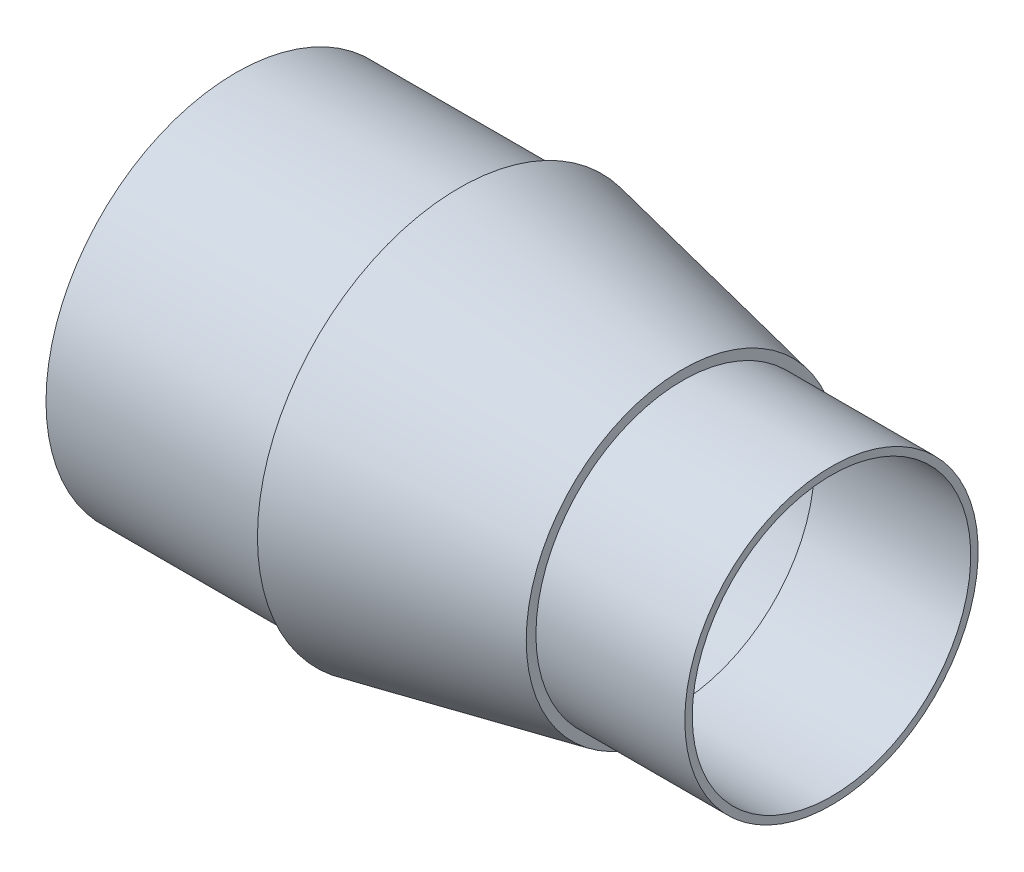
ISO-10303-21;
HEADER;
FILE_DESCRIPTION(('STEP AP214'),'2;1');
FILE_NAME('part.step','',(''),(''),'','','');
FILE_SCHEMA(('AUTOMOTIVE_DESIGN { 1 0 10303 214 1 1 1 1 }'));
ENDSEC;
DATA;
#1=APPLICATION_CONTEXT('core data for automotive mechanical design processes');
#2=APPLICATION_PROTOCOL_DEFINITION('international standard','automotive_design',2000,#1);
#3=PRODUCT_CONTEXT('',#1,'mechanical');
#4=PRODUCT('Part','Part','',(#3));
#5=PRODUCT_RELATED_PRODUCT_CATEGORY('part','',(#4));
#6=PRODUCT_DEFINITION_FORMATION('','',#4);
#7=PRODUCT_DEFINITION_CONTEXT('part definition',#1,'design');
#8=PRODUCT_DEFINITION('design','',#6,#7);
#9=PRODUCT_DEFINITION_SHAPE('','',#8);
#10=(LENGTH_UNIT() NAMED_UNIT(*) SI_UNIT(.MILLI.,.METRE.));
#11=(NAMED_UNIT(*) PLANE_ANGLE_UNIT() SI_UNIT($,.RADIAN.));
#12=(NAMED_UNIT(*) SI_UNIT($,.STERADIAN.) SOLID_ANGLE_UNIT());
#13=UNCERTAINTY_MEASURE_WITH_UNIT(LENGTH_MEASURE(1.E-05),#10,'distance_accuracy_value','');
#14=(GEOMETRIC_REPRESENTATION_CONTEXT(3) GLOBAL_UNCERTAINTY_ASSIGNED_CONTEXT((#13)) GLOBAL_UNIT_ASSIGNED_CONTEXT((#10,
#11,#12)) REPRESENTATION_CONTEXT('',''));
#15=CARTESIAN_POINT('',(0.,0.,0.));
#16=DIRECTION('',(0.,0.,1.));
#17=DIRECTION('',(1.,0.,0.));
#18=AXIS2_PLACEMENT_3D('',#15,#16,#17);
#19=CARTESIAN_POINT('',(0.,0.,-64.77));
#20=DIRECTION('',(1.,0.,0.));
#21=DIRECTION('',(0.,0.,-1.));
#22=AXIS2_PLACEMENT_3D('',#19,#20,#21);
#23=PLANE('',#22);
#24=CARTESIAN_POINT('',(0.,0.,0.));
#25=DIRECTION('',(1.,0.,0.));
#26=DIRECTION('',(0.,0.,-1.));
#27=AXIS2_PLACEMENT_3D('',#24,#25,#26);
#28=CIRCLE('',#27,62.23);
#29=CARTESIAN_POINT('',(0.,0.,-62.23));
#30=VERTEX_POINT('',#29);
#31=EDGE_CURVE('E60',#30,#30,#28,.F.);
#32=ORIENTED_EDGE('',*,*,#31,.F.);
#33=EDGE_LOOP('',(#32));
#34=FACE_BOUND('',#33,.T.);
#35=CARTESIAN_POINT('',(0.,0.,0.));
#36=DIRECTION('',(-1.,0.,0.));
#37=DIRECTION('',(0.,0.,1.));
#38=AXIS2_PLACEMENT_3D('',#35,#36,#37);
#39=CIRCLE('',#38,64.77);
#40=CARTESIAN_POINT('',(0.,0.,64.77));
#41=VERTEX_POINT('',#40);
#42=EDGE_CURVE('E10',#41,#41,#39,.T.);
#43=ORIENTED_EDGE('',*,*,#42,.T.);
#44=EDGE_LOOP('',(#43));
#45=FACE_BOUND('',#44,.T.);
#46=ADVANCED_FACE('F35',(#34,#45),#23,.F.);
#47=CARTESIAN_POINT('',(0.,0.,0.));
#48=DIRECTION('',(-1.,0.,0.));
#49=DIRECTION('',(0.,0.,1.));
#50=AXIS2_PLACEMENT_3D('',#47,#48,#49);
#51=CYLINDRICAL_SURFACE('',#50,64.77);
#52=ORIENTED_EDGE('',*,*,#42,.F.);
#53=EDGE_LOOP('',(#52));
#54=FACE_BOUND('',#53,.T.);
#55=CARTESIAN_POINT('',(76.2,0.,0.));
#56=DIRECTION('',(-1.,0.,0.));
#57=DIRECTION('',(0.,0.,1.));
#58=AXIS2_PLACEMENT_3D('',#55,#56,#57);
#59=CIRCLE('',#58,64.77);
#60=CARTESIAN_POINT('',(76.2,0.,64.77));
#61=VERTEX_POINT('',#60);
#62=EDGE_CURVE('E41',#61,#61,#59,.T.);
#63=ORIENTED_EDGE('',*,*,#62,.T.);
#64=EDGE_LOOP('',(#63));
#65=FACE_BOUND('',#64,.T.);
#66=ADVANCED_FACE('F97',(#54,#65),#51,.T.);
#67=CARTESIAN_POINT('',(76.2,0.,-68.834));
#68=DIRECTION('',(1.,0.,0.));
#69=DIRECTION('',(0.,0.,-1.));
#70=AXIS2_PLACEMENT_3D('',#67,#68,#69);
#71=PLANE('',#70);
#72=ORIENTED_EDGE('',*,*,#62,.F.);
#73=EDGE_LOOP('',(#72));
#74=FACE_BOUND('',#73,.T.);
#75=CARTESIAN_POINT('',(76.2,0.,0.));
#76=DIRECTION('',(-1.,0.,0.));
#77=DIRECTION('',(0.,0.,1.));
#78=AXIS2_PLACEMENT_3D('',#75,#76,#77);
#79=CIRCLE('',#78,68.834);
#80=CARTESIAN_POINT('',(76.2,0.,68.834));
#81=VERTEX_POINT('',#80);
#82=EDGE_CURVE('E45',#81,#81,#79,.T.);
#83=ORIENTED_EDGE('',*,*,#82,.T.);
#84=EDGE_LOOP('',(#83));
#85=FACE_BOUND('',#84,.T.);
#86=ADVANCED_FACE('F102',(#74,#85),#71,.F.);
#87=CARTESIAN_POINT('',(152.4,0.,0.));
#88=DIRECTION('',(-1.,0.,0.));
#89=DIRECTION('',(0.,0.,1.));
#90=AXIS2_PLACEMENT_3D('',#87,#88,#89);
#91=CONICAL_SURFACE('',#90,53.34,0.200598623847718);
#92=ORIENTED_EDGE('',*,*,#82,.F.);
#93=EDGE_LOOP('',(#92));
#94=FACE_BOUND('',#93,.T.);
#95=CARTESIAN_POINT('',(152.4,0.,0.));
#96=DIRECTION('',(-1.,0.,0.));
#97=DIRECTION('',(0.,0.,1.));
#98=AXIS2_PLACEMENT_3D('',#95,#96,#97);
#99=CIRCLE('',#98,53.34);
#100=CARTESIAN_POINT('',(152.4,0.,53.34));
#101=VERTEX_POINT('',#100);
#102=EDGE_CURVE('E49',#101,#101,#99,.T.);
#103=ORIENTED_EDGE('',*,*,#102,.T.);
#104=EDGE_LOOP('',(#103));
#105=FACE_BOUND('',#104,.T.);
#106=ADVANCED_FACE('F108',(#94,#105),#91,.T.);
#107=CARTESIAN_POINT('',(152.4,0.,-53.34));
#108=DIRECTION('',(-1.,0.,0.));
#109=DIRECTION('',(0.,0.,1.));
#110=AXIS2_PLACEMENT_3D('',#107,#108,#109);
#111=PLANE('',#110);
#112=ORIENTED_EDGE('',*,*,#102,.F.);
#113=EDGE_LOOP('',(#112));
#114=FACE_BOUND('',#113,.T.);
#115=CARTESIAN_POINT('',(152.4,0.,0.));
#116=DIRECTION('',(-1.,0.,0.));
#117=DIRECTION('',(0.,0.,1.));
#118=AXIS2_PLACEMENT_3D('',#115,#116,#117);
#119=CIRCLE('',#118,50.038);
#120=CARTESIAN_POINT('',(152.4,0.,50.038));
#121=VERTEX_POINT('',#120);
#122=EDGE_CURVE('E54',#121,#121,#119,.T.);
#123=ORIENTED_EDGE('',*,*,#122,.T.);
#124=EDGE_LOOP('',(#123));
#125=FACE_BOUND('',#124,.T.);
#126=ADVANCED_FACE('F114',(#114,#125),#111,.F.);
#127=CARTESIAN_POINT('',(0.,0.,0.));
#128=DIRECTION('',(-1.,0.,0.));
#129=DIRECTION('',(0.,0.,1.));
#130=AXIS2_PLACEMENT_3D('',#127,#128,#129);
#131=CYLINDRICAL_SURFACE('',#130,50.038);
#132=ORIENTED_EDGE('',*,*,#122,.F.);
#133=EDGE_LOOP('',(#132));
#134=FACE_BOUND('',#133,.T.);
#135=CARTESIAN_POINT('',(203.2,0.,0.));
#136=DIRECTION('',(-1.,0.,0.));
#137=DIRECTION('',(0.,0.,1.));
#138=AXIS2_PLACEMENT_3D('',#135,#136,#137);
#139=CIRCLE('',#138,50.038);
#140=CARTESIAN_POINT('',(203.2,0.,50.038));
#141=VERTEX_POINT('',#140);
#142=EDGE_CURVE('E57',#141,#141,#139,.T.);
#143=ORIENTED_EDGE('',*,*,#142,.T.);
#144=EDGE_LOOP('',(#143));
#145=FACE_BOUND('',#144,.T.);
#146=ADVANCED_FACE('F93',(#134,#145),#131,.T.);
#147=CARTESIAN_POINT('',(203.2,0.,-50.038));
#148=DIRECTION('',(-1.,0.,0.));
#149=DIRECTION('',(0.,0.,1.));
#150=AXIS2_PLACEMENT_3D('',#147,#148,#149);
#151=PLANE('',#150);
#152=CARTESIAN_POINT('',(203.2,0.,0.));
#153=DIRECTION('',(-1.,0.,0.));
#154=DIRECTION('',(0.,0.,1.));
#155=AXIS2_PLACEMENT_3D('',#152,#153,#154);
#156=CIRCLE('',#155,47.498);
#157=CARTESIAN_POINT('',(203.2,0.,47.498));
#158=VERTEX_POINT('',#157);
#159=EDGE_CURVE('E61',#158,#158,#156,.T.);
#160=ORIENTED_EDGE('',*,*,#159,.T.);
#161=EDGE_LOOP('',(#160));
#162=FACE_BOUND('',#161,.T.);
#163=ORIENTED_EDGE('',*,*,#142,.F.);
#164=EDGE_LOOP('',(#163));
#165=FACE_BOUND('',#164,.T.);
#166=ADVANCED_FACE('F84',(#162,#165),#151,.F.);
#167=CARTESIAN_POINT('',(0.,0.,0.));
#168=DIRECTION('',(-1.,0.,0.));
#169=DIRECTION('',(0.,0.,1.));
#170=AXIS2_PLACEMENT_3D('',#167,#168,#169);
#171=CYLINDRICAL_SURFACE('',#170,62.23);
#172=ORIENTED_EDGE('',*,*,#31,.T.);
#173=EDGE_LOOP('',(#172));
#174=FACE_BOUND('',#173,.T.);
#175=CARTESIAN_POINT('',(78.74,0.,0.));
#176=DIRECTION('',(1.,0.,0.));
#177=DIRECTION('',(0.,0.,-1.));
#178=AXIS2_PLACEMENT_3D('',#175,#176,#177);
#179=CIRCLE('',#178,62.23);
#180=CARTESIAN_POINT('',(78.74,0.,-62.23));
#181=VERTEX_POINT('',#180);
#182=EDGE_CURVE('E67',#181,#181,#179,.F.);
#183=ORIENTED_EDGE('',*,*,#182,.F.);
#184=EDGE_LOOP('',(#183));
#185=FACE_BOUND('',#184,.T.);
#186=ADVANCED_FACE('F82',(#174,#185),#171,.F.);
#187=CARTESIAN_POINT('',(78.74,0.,-68.834));
#188=DIRECTION('',(1.,0.,0.));
#189=DIRECTION('',(0.,0.,-1.));
#190=AXIS2_PLACEMENT_3D('',#187,#188,#189);
#191=PLANE('',#190);
#192=ORIENTED_EDGE('',*,*,#182,.T.);
#193=EDGE_LOOP('',(#192));
#194=FACE_BOUND('',#193,.T.);
#195=CARTESIAN_POINT('',(78.74,0.,0.));
#196=DIRECTION('',(1.,0.,0.));
#197=DIRECTION('',(0.,0.,-1.));
#198=AXIS2_PLACEMENT_3D('',#195,#196,#197);
#199=CIRCLE('',#198,65.7255576741541);
#200=CARTESIAN_POINT('',(78.74,0.,-65.7255576741541));
#201=VERTEX_POINT('',#200);
#202=EDGE_CURVE('E73',#201,#201,#199,.F.);
#203=ORIENTED_EDGE('',*,*,#202,.F.);
#204=EDGE_LOOP('',(#203));
#205=FACE_BOUND('',#204,.T.);
#206=ADVANCED_FACE('F79',(#194,#205),#191,.T.);
#207=CARTESIAN_POINT('',(151.893889794571,0.,0.));
#208=DIRECTION('',(-1.,0.,0.));
#209=DIRECTION('',(0.,0.,1.));
#210=AXIS2_PLACEMENT_3D('',#207,#208,#209);
#211=CONICAL_SURFACE('',#210,50.8509334159246,0.200598623847718);
#212=ORIENTED_EDGE('',*,*,#202,.T.);
#213=EDGE_LOOP('',(#212));
#214=FACE_BOUND('',#213,.T.);
#215=CARTESIAN_POINT('',(149.86,0.,0.));
#216=DIRECTION('',(-1.,0.,0.));
#217=DIRECTION('',(0.,0.,1.));
#218=AXIS2_PLACEMENT_3D('',#215,#216,#217);
#219=CIRCLE('',#218,51.2644910074874);
#220=CARTESIAN_POINT('',(149.86,0.,51.2644910074874));
#221=VERTEX_POINT('',#220);
#222=EDGE_CURVE('E70',#221,#221,#219,.T.);
#223=ORIENTED_EDGE('',*,*,#222,.F.);
#224=EDGE_LOOP('',(#223));
#225=FACE_BOUND('',#224,.T.);
#226=ADVANCED_FACE('F91',(#214,#225),#211,.F.);
#227=CARTESIAN_POINT('',(149.86,0.,-53.34));
#228=DIRECTION('',(-1.,0.,0.));
#229=DIRECTION('',(0.,0.,1.));
#230=AXIS2_PLACEMENT_3D('',#227,#228,#229);
#231=PLANE('',#230);
#232=ORIENTED_EDGE('',*,*,#222,.T.);
#233=EDGE_LOOP('',(#232));
#234=FACE_BOUND('',#233,.T.);
#235=CARTESIAN_POINT('',(149.86,0.,0.));
#236=DIRECTION('',(-1.,0.,0.));
#237=DIRECTION('',(0.,0.,1.));
#238=AXIS2_PLACEMENT_3D('',#235,#236,#237);
#239=CIRCLE('',#238,47.498);
#240=CARTESIAN_POINT('',(149.86,0.,47.498));
#241=VERTEX_POINT('',#240);
#242=EDGE_CURVE('E64',#241,#241,#239,.T.);
#243=ORIENTED_EDGE('',*,*,#242,.F.);
#244=EDGE_LOOP('',(#243));
#245=FACE_BOUND('',#244,.T.);
#246=ADVANCED_FACE('F125',(#234,#245),#231,.T.);
#247=CARTESIAN_POINT('',(0.,0.,0.));
#248=DIRECTION('',(-1.,0.,0.));
#249=DIRECTION('',(0.,0.,1.));
#250=AXIS2_PLACEMENT_3D('',#247,#248,#249);
#251=CYLINDRICAL_SURFACE('',#250,47.498);
#252=ORIENTED_EDGE('',*,*,#242,.T.);
#253=EDGE_LOOP('',(#252));
#254=FACE_BOUND('',#253,.T.);
#255=ORIENTED_EDGE('',*,*,#159,.F.);
#256=EDGE_LOOP('',(#255));
#257=FACE_BOUND('',#256,.T.);
#258=ADVANCED_FACE('F122',(#254,#257),#251,.F.);
#259=CLOSED_SHELL('',(#46,#66,#86,#106,#126,#146,#166,#186,#206,#226,#246,#258));
#260=MANIFOLD_SOLID_BREP('B2',#259);
#261=ADVANCED_BREP_SHAPE_REPRESENTATION('',(#18,#260),#14);
#262=SHAPE_DEFINITION_REPRESENTATION(#9,#261);
ENDSEC;
END-ISO-10303-21;
